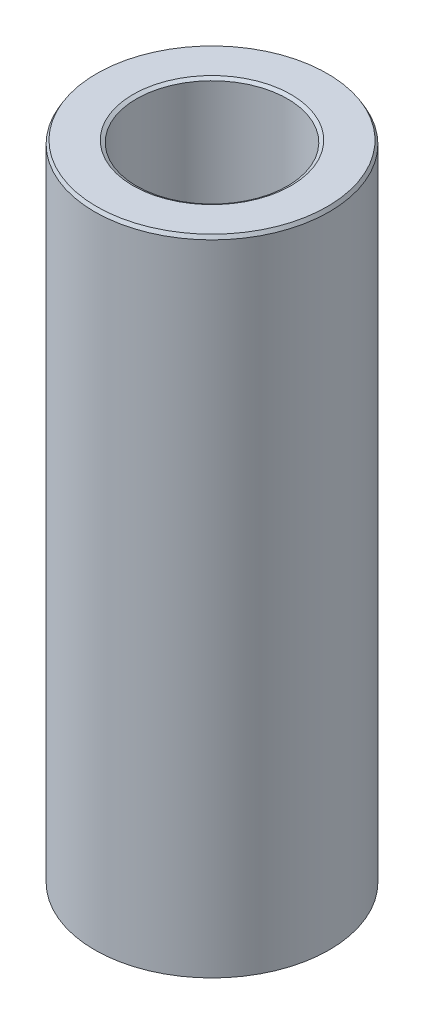
ISO-10303-21;
HEADER;
FILE_DESCRIPTION(('STEP AP214'),'2;1');
FILE_NAME('part.step','',(''),(''),'','','');
FILE_SCHEMA(('AUTOMOTIVE_DESIGN { 1 0 10303 214 1 1 1 1 }'));
ENDSEC;
DATA;
#1=APPLICATION_CONTEXT('core data for automotive mechanical design processes');
#2=APPLICATION_PROTOCOL_DEFINITION('international standard','automotive_design',2000,#1);
#3=PRODUCT_CONTEXT('',#1,'mechanical');
#4=PRODUCT('Part','Part','',(#3));
#5=PRODUCT_RELATED_PRODUCT_CATEGORY('part','',(#4));
#6=PRODUCT_DEFINITION_FORMATION('','',#4);
#7=PRODUCT_DEFINITION_CONTEXT('part definition',#1,'design');
#8=PRODUCT_DEFINITION('design','',#6,#7);
#9=PRODUCT_DEFINITION_SHAPE('','',#8);
#10=(LENGTH_UNIT() NAMED_UNIT(*) SI_UNIT(.MILLI.,.METRE.));
#11=(NAMED_UNIT(*) PLANE_ANGLE_UNIT() SI_UNIT($,.RADIAN.));
#12=(NAMED_UNIT(*) SI_UNIT($,.STERADIAN.) SOLID_ANGLE_UNIT());
#13=UNCERTAINTY_MEASURE_WITH_UNIT(LENGTH_MEASURE(1.E-05),#10,'distance_accuracy_value','');
#14=(GEOMETRIC_REPRESENTATION_CONTEXT(3) GLOBAL_UNCERTAINTY_ASSIGNED_CONTEXT((#13)) GLOBAL_UNIT_ASSIGNED_CONTEXT((#10,
#11,#12)) REPRESENTATION_CONTEXT('',''));
#15=CARTESIAN_POINT('',(0.,0.,0.));
#16=DIRECTION('',(0.,0.,1.));
#17=DIRECTION('',(1.,0.,0.));
#18=AXIS2_PLACEMENT_3D('',#15,#16,#17);
#19=CARTESIAN_POINT('',(0.,219.810319966606,0.));
#20=DIRECTION('',(0.,-1.,0.));
#21=DIRECTION('',(0.,0.,-1.));
#22=AXIS2_PLACEMENT_3D('',#19,#20,#21);
#23=CYLINDRICAL_SURFACE('',#22,40.);
#24=CARTESIAN_POINT('',(0.,0.690113309893881,0.));
#25=DIRECTION('',(0.,1.,0.));
#26=DIRECTION('',(0.,0.,1.));
#27=AXIS2_PLACEMENT_3D('',#24,#25,#26);
#28=CIRCLE('',#27,40.);
#29=CARTESIAN_POINT('',(0.,0.690113309893881,40.));
#30=VERTEX_POINT('',#29);
#31=EDGE_CURVE('E10',#30,#30,#28,.T.);
#32=ORIENTED_EDGE('',*,*,#31,.T.);
#33=EDGE_LOOP('',(#32));
#34=FACE_BOUND('',#33,.T.);
#35=CARTESIAN_POINT('',(0.,218.61500865089,0.));
#36=DIRECTION('',(0.,1.,0.));
#37=DIRECTION('',(0.,0.,1.));
#38=AXIS2_PLACEMENT_3D('',#35,#36,#37);
#39=CIRCLE('',#38,40.);
#40=CARTESIAN_POINT('',(0.,218.61500865089,40.));
#41=VERTEX_POINT('',#40);
#42=EDGE_CURVE('E50',#41,#41,#39,.F.);
#43=ORIENTED_EDGE('',*,*,#42,.T.);
#44=EDGE_LOOP('',(#43));
#45=FACE_BOUND('',#44,.T.);
#46=ADVANCED_FACE('F39',(#34,#45),#23,.T.);
#47=CARTESIAN_POINT('',(0.,219.810319966606,0.));
#48=DIRECTION('',(0.,1.,0.));
#49=DIRECTION('',(0.,0.,1.));
#50=AXIS2_PLACEMENT_3D('',#47,#48,#49);
#51=PLANE('',#50);
#52=CARTESIAN_POINT('',(0.,219.810319966606,0.));
#53=DIRECTION('',(0.,1.,0.));
#54=DIRECTION('',(0.,0.,1.));
#55=AXIS2_PLACEMENT_3D('',#52,#53,#54);
#56=CIRCLE('',#55,26.9537578600074);
#57=CARTESIAN_POINT('',(0.,219.810319966606,26.9537578600074));
#58=VERTEX_POINT('',#57);
#59=EDGE_CURVE('E58',#58,#58,#56,.F.);
#60=ORIENTED_EDGE('',*,*,#59,.T.);
#61=EDGE_LOOP('',(#60));
#62=FACE_BOUND('',#61,.T.);
#63=CARTESIAN_POINT('',(0.,219.810319966606,0.));
#64=DIRECTION('',(0.,1.,0.));
#65=DIRECTION('',(0.,0.,1.));
#66=AXIS2_PLACEMENT_3D('',#63,#64,#65);
#67=CIRCLE('',#66,39.309886690106);
#68=CARTESIAN_POINT('',(0.,219.810319966606,39.309886690106));
#69=VERTEX_POINT('',#68);
#70=EDGE_CURVE('E61',#69,#69,#67,.T.);
#71=ORIENTED_EDGE('',*,*,#70,.T.);
#72=EDGE_LOOP('',(#71));
#73=FACE_BOUND('',#72,.T.);
#74=ADVANCED_FACE('F88',(#62,#73),#51,.T.);
#75=CARTESIAN_POINT('',(0.,0.,0.));
#76=DIRECTION('',(0.,1.,0.));
#77=DIRECTION('',(0.,0.,1.));
#78=AXIS2_PLACEMENT_3D('',#75,#76,#77);
#79=PLANE('',#78);
#80=CARTESIAN_POINT('',(0.,0.,0.));
#81=DIRECTION('',(0.,1.,0.));
#82=DIRECTION('',(0.,0.,1.));
#83=AXIS2_PLACEMENT_3D('',#80,#81,#82);
#84=CIRCLE('',#83,26.4485598541855);
#85=CARTESIAN_POINT('',(0.,0.,26.4485598541855));
#86=VERTEX_POINT('',#85);
#87=EDGE_CURVE('E51',#86,#86,#84,.T.);
#88=ORIENTED_EDGE('',*,*,#87,.T.);
#89=EDGE_LOOP('',(#88));
#90=FACE_BOUND('',#89,.T.);
#91=CARTESIAN_POINT('',(0.,0.,0.));
#92=DIRECTION('',(0.,1.,0.));
#93=DIRECTION('',(0.,0.,1.));
#94=AXIS2_PLACEMENT_3D('',#91,#92,#93);
#95=CIRCLE('',#94,38.8046886842842);
#96=CARTESIAN_POINT('',(0.,0.,38.8046886842842));
#97=VERTEX_POINT('',#96);
#98=EDGE_CURVE('E54',#97,#97,#95,.F.);
#99=ORIENTED_EDGE('',*,*,#98,.T.);
#100=EDGE_LOOP('',(#99));
#101=FACE_BOUND('',#100,.T.);
#102=ADVANCED_FACE('F83',(#90,#101),#79,.F.);
#103=CARTESIAN_POINT('',(0.,219.810319966606,0.));
#104=DIRECTION('',(0.,-1.,0.));
#105=DIRECTION('',(0.,0.,-1.));
#106=AXIS2_PLACEMENT_3D('',#103,#104,#105);
#107=CYLINDRICAL_SURFACE('',#106,25.7584465442916);
#108=CARTESIAN_POINT('',(0.,219.120206656712,0.));
#109=DIRECTION('',(0.,1.,0.));
#110=DIRECTION('',(0.,0.,1.));
#111=AXIS2_PLACEMENT_3D('',#108,#109,#110);
#112=CIRCLE('',#111,25.7584465442916);
#113=CARTESIAN_POINT('',(0.,219.120206656712,25.7584465442916));
#114=VERTEX_POINT('',#113);
#115=EDGE_CURVE('E67',#114,#114,#112,.T.);
#116=ORIENTED_EDGE('',*,*,#115,.T.);
#117=EDGE_LOOP('',(#116));
#118=FACE_BOUND('',#117,.T.);
#119=CARTESIAN_POINT('',(0.,1.19531131571585,0.));
#120=DIRECTION('',(0.,1.,0.));
#121=DIRECTION('',(0.,0.,1.));
#122=AXIS2_PLACEMENT_3D('',#119,#120,#121);
#123=CIRCLE('',#122,25.7584465442916);
#124=CARTESIAN_POINT('',(0.,1.19531131571585,25.7584465442916));
#125=VERTEX_POINT('',#124);
#126=EDGE_CURVE('E69',#125,#125,#123,.F.);
#127=ORIENTED_EDGE('',*,*,#126,.T.);
#128=EDGE_LOOP('',(#127));
#129=FACE_BOUND('',#128,.T.);
#130=ADVANCED_FACE('F71',(#118,#129),#107,.F.);
#131=CARTESIAN_POINT('',(0.,219.120206656712,0.));
#132=DIRECTION('',(0.,1.,0.));
#133=DIRECTION('',(0.,0.,1.));
#134=AXIS2_PLACEMENT_3D('',#131,#132,#133);
#135=CONICAL_SURFACE('',#134,25.7584465442916,1.04719755119659);
#136=ORIENTED_EDGE('',*,*,#59,.F.);
#137=EDGE_LOOP('',(#136));
#138=FACE_BOUND('',#137,.T.);
#139=ORIENTED_EDGE('',*,*,#115,.F.);
#140=EDGE_LOOP('',(#139));
#141=FACE_BOUND('',#140,.T.);
#142=ADVANCED_FACE('F77',(#138,#141),#135,.F.);
#143=CARTESIAN_POINT('',(0.,0.,0.));
#144=DIRECTION('',(0.,-1.,0.));
#145=DIRECTION('',(0.,0.,-1.));
#146=AXIS2_PLACEMENT_3D('',#143,#144,#145);
#147=CONICAL_SURFACE('',#146,26.4485598541855,0.523598775598292);
#148=ORIENTED_EDGE('',*,*,#126,.F.);
#149=EDGE_LOOP('',(#148));
#150=FACE_BOUND('',#149,.T.);
#151=ORIENTED_EDGE('',*,*,#87,.F.);
#152=EDGE_LOOP('',(#151));
#153=FACE_BOUND('',#152,.T.);
#154=ADVANCED_FACE('F73',(#150,#153),#147,.F.);
#155=CARTESIAN_POINT('',(0.,0.690113309893881,0.));
#156=DIRECTION('',(0.,1.,0.));
#157=DIRECTION('',(0.,0.,1.));
#158=AXIS2_PLACEMENT_3D('',#155,#156,#157);
#159=CONICAL_SURFACE('',#158,40.,1.04719755119662);
#160=ORIENTED_EDGE('',*,*,#98,.F.);
#161=EDGE_LOOP('',(#160));
#162=FACE_BOUND('',#161,.T.);
#163=ORIENTED_EDGE('',*,*,#31,.F.);
#164=EDGE_LOOP('',(#163));
#165=FACE_BOUND('',#164,.T.);
#166=ADVANCED_FACE('F76',(#162,#165),#159,.T.);
#167=CARTESIAN_POINT('',(0.,219.810319966606,0.));
#168=DIRECTION('',(0.,-1.,0.));
#169=DIRECTION('',(0.,0.,-1.));
#170=AXIS2_PLACEMENT_3D('',#167,#168,#169);
#171=CONICAL_SURFACE('',#170,39.309886690106,0.523598775598293);
#172=ORIENTED_EDGE('',*,*,#42,.F.);
#173=EDGE_LOOP('',(#172));
#174=FACE_BOUND('',#173,.T.);
#175=ORIENTED_EDGE('',*,*,#70,.F.);
#176=EDGE_LOOP('',(#175));
#177=FACE_BOUND('',#176,.T.);
#178=ADVANCED_FACE('F45',(#174,#177),#171,.T.);
#179=CLOSED_SHELL('',(#46,#74,#102,#130,#142,#154,#166,#178));
#180=MANIFOLD_SOLID_BREP('B2',#179);
#181=ADVANCED_BREP_SHAPE_REPRESENTATION('',(#18,#180),#14);
#182=SHAPE_DEFINITION_REPRESENTATION(#9,#181);
ENDSEC;
END-ISO-10303-21;
